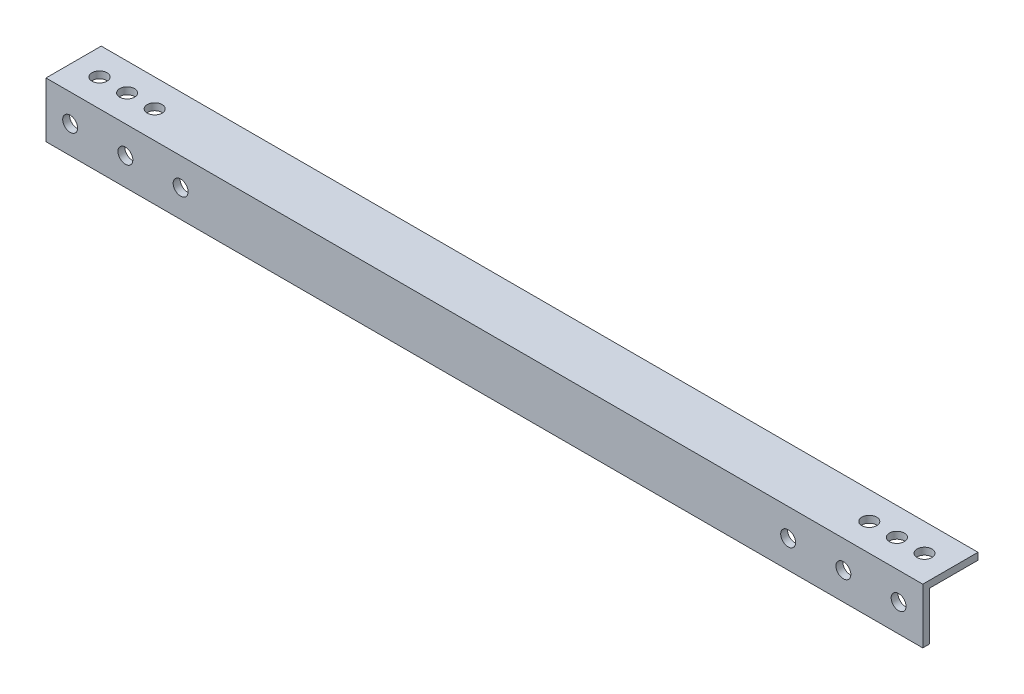
ISO-10303-21;
HEADER;
FILE_DESCRIPTION(('STEP AP214'),'2;1');
FILE_NAME('part.step','',(''),(''),'','','');
FILE_SCHEMA(('AUTOMOTIVE_DESIGN { 1 0 10303 214 1 1 1 1 }'));
ENDSEC;
DATA;
#1=APPLICATION_CONTEXT('core data for automotive mechanical design processes');
#2=APPLICATION_PROTOCOL_DEFINITION('international standard','automotive_design',2000,#1);
#3=PRODUCT_CONTEXT('',#1,'mechanical');
#4=PRODUCT('Part','Part','',(#3));
#5=PRODUCT_RELATED_PRODUCT_CATEGORY('part','',(#4));
#6=PRODUCT_DEFINITION_FORMATION('','',#4);
#7=PRODUCT_DEFINITION_CONTEXT('part definition',#1,'design');
#8=PRODUCT_DEFINITION('design','',#6,#7);
#9=PRODUCT_DEFINITION_SHAPE('','',#8);
#10=(LENGTH_UNIT() NAMED_UNIT(*) SI_UNIT(.MILLI.,.METRE.));
#11=(NAMED_UNIT(*) PLANE_ANGLE_UNIT() SI_UNIT($,.RADIAN.));
#12=(NAMED_UNIT(*) SI_UNIT($,.STERADIAN.) SOLID_ANGLE_UNIT());
#13=UNCERTAINTY_MEASURE_WITH_UNIT(LENGTH_MEASURE(1.E-05),#10,'distance_accuracy_value','');
#14=(GEOMETRIC_REPRESENTATION_CONTEXT(3) GLOBAL_UNCERTAINTY_ASSIGNED_CONTEXT((#13)) GLOBAL_UNIT_ASSIGNED_CONTEXT((#10,
#11,#12)) REPRESENTATION_CONTEXT('',''));
#15=CARTESIAN_POINT('',(0.,0.,0.));
#16=DIRECTION('',(0.,0.,1.));
#17=DIRECTION('',(1.,0.,0.));
#18=AXIS2_PLACEMENT_3D('',#15,#16,#17);
#19=CARTESIAN_POINT('',(403.225,0.,0.));
#20=DIRECTION('',(0.,0.,-1.));
#21=DIRECTION('',(0.,1.,0.));
#22=AXIS2_PLACEMENT_3D('',#19,#20,#21);
#23=PLANE('',#22);
#24=CARTESIAN_POINT('',(11.1125,-12.7,0.));
#25=DIRECTION('',(0.,0.,1.));
#26=DIRECTION('',(1.,0.,0.));
#27=AXIS2_PLACEMENT_3D('',#24,#25,#26);
#28=CIRCLE('',#27,3.429);
#29=CARTESIAN_POINT('',(14.5415,-12.7,0.));
#30=VERTEX_POINT('',#29);
#31=EDGE_CURVE('E173',#30,#30,#28,.T.);
#32=ORIENTED_EDGE('',*,*,#31,.F.);
#33=EDGE_LOOP('',(#32));
#34=FACE_BOUND('',#33,.T.);
#35=CARTESIAN_POINT('',(36.5125,-12.7,0.));
#36=DIRECTION('',(0.,0.,1.));
#37=DIRECTION('',(1.,0.,0.));
#38=AXIS2_PLACEMENT_3D('',#35,#36,#37);
#39=CIRCLE('',#38,3.429);
#40=CARTESIAN_POINT('',(39.9415,-12.7,0.));
#41=VERTEX_POINT('',#40);
#42=EDGE_CURVE('E177',#41,#41,#39,.T.);
#43=ORIENTED_EDGE('',*,*,#42,.F.);
#44=EDGE_LOOP('',(#43));
#45=FACE_BOUND('',#44,.T.);
#46=CARTESIAN_POINT('',(61.9125,-12.7,0.));
#47=DIRECTION('',(0.,0.,1.));
#48=DIRECTION('',(1.,0.,0.));
#49=AXIS2_PLACEMENT_3D('',#46,#47,#48);
#50=CIRCLE('',#49,3.429);
#51=CARTESIAN_POINT('',(65.3415,-12.7,0.));
#52=VERTEX_POINT('',#51);
#53=EDGE_CURVE('E181',#52,#52,#50,.T.);
#54=ORIENTED_EDGE('',*,*,#53,.F.);
#55=EDGE_LOOP('',(#54));
#56=FACE_BOUND('',#55,.T.);
#57=CARTESIAN_POINT('',(341.3125,-12.7,0.));
#58=DIRECTION('',(0.,0.,1.));
#59=DIRECTION('',(-1.,0.,0.));
#60=AXIS2_PLACEMENT_3D('',#57,#58,#59);
#61=CIRCLE('',#60,3.429);
#62=CARTESIAN_POINT('',(337.8835,-12.7,0.));
#63=VERTEX_POINT('',#62);
#64=EDGE_CURVE('E185',#63,#63,#61,.T.);
#65=ORIENTED_EDGE('',*,*,#64,.F.);
#66=EDGE_LOOP('',(#65));
#67=FACE_BOUND('',#66,.T.);
#68=CARTESIAN_POINT('',(366.7125,-12.7,0.));
#69=DIRECTION('',(0.,0.,1.));
#70=DIRECTION('',(-1.,0.,0.));
#71=AXIS2_PLACEMENT_3D('',#68,#69,#70);
#72=CIRCLE('',#71,3.429);
#73=CARTESIAN_POINT('',(363.2835,-12.7,0.));
#74=VERTEX_POINT('',#73);
#75=EDGE_CURVE('E189',#74,#74,#72,.T.);
#76=ORIENTED_EDGE('',*,*,#75,.F.);
#77=EDGE_LOOP('',(#76));
#78=FACE_BOUND('',#77,.T.);
#79=CARTESIAN_POINT('',(392.1125,-12.7,0.));
#80=DIRECTION('',(0.,0.,1.));
#81=DIRECTION('',(-1.,0.,0.));
#82=AXIS2_PLACEMENT_3D('',#79,#80,#81);
#83=CIRCLE('',#82,3.429);
#84=CARTESIAN_POINT('',(388.6835,-12.7,0.));
#85=VERTEX_POINT('',#84);
#86=EDGE_CURVE('E192',#85,#85,#83,.T.);
#87=ORIENTED_EDGE('',*,*,#86,.F.);
#88=EDGE_LOOP('',(#87));
#89=FACE_BOUND('',#88,.T.);
#90=DIRECTION('',(0.,-1.,0.));
#91=VECTOR('',#90,1.);
#92=CARTESIAN_POINT('',(0.,0.,0.));
#93=LINE('',#92,#91);
#94=CARTESIAN_POINT('',(0.,0.,0.));
#95=VERTEX_POINT('',#94);
#96=CARTESIAN_POINT('',(0.,-25.4,0.));
#97=VERTEX_POINT('',#96);
#98=EDGE_CURVE('E127',#95,#97,#93,.T.);
#99=ORIENTED_EDGE('',*,*,#98,.T.);
#100=DIRECTION('',(-1.,0.,0.));
#101=VECTOR('',#100,1.);
#102=CARTESIAN_POINT('',(403.225,-25.4,0.));
#103=LINE('',#102,#101);
#104=CARTESIAN_POINT('',(403.225,-25.4,0.));
#105=VERTEX_POINT('',#104);
#106=EDGE_CURVE('E12',#105,#97,#103,.T.);
#107=ORIENTED_EDGE('',*,*,#106,.F.);
#108=DIRECTION('',(0.,-1.,0.));
#109=VECTOR('',#108,1.);
#110=CARTESIAN_POINT('',(403.225,0.,0.));
#111=LINE('',#110,#109);
#112=CARTESIAN_POINT('',(403.225,0.,0.));
#113=VERTEX_POINT('',#112);
#114=EDGE_CURVE('E138',#113,#105,#111,.T.);
#115=ORIENTED_EDGE('',*,*,#114,.F.);
#116=DIRECTION('',(-1.,0.,0.));
#117=VECTOR('',#116,1.);
#118=CARTESIAN_POINT('',(403.225,0.,0.));
#119=LINE('',#118,#117);
#120=EDGE_CURVE('E123',#113,#95,#119,.T.);
#121=ORIENTED_EDGE('',*,*,#120,.T.);
#122=EDGE_LOOP('',(#99,#107,#115,#121));
#123=FACE_BOUND('',#122,.T.);
#124=ADVANCED_FACE('F43',(#34,#45,#56,#67,#78,#89,#123),#23,.F.);
#125=CARTESIAN_POINT('',(403.225,-25.4,-3.17499999999991));
#126=DIRECTION('',(0.,1.,0.));
#127=DIRECTION('',(0.,0.,1.));
#128=AXIS2_PLACEMENT_3D('',#125,#126,#127);
#129=PLANE('',#128);
#130=DIRECTION('',(0.,0.,-1.));
#131=VECTOR('',#130,1.);
#132=CARTESIAN_POINT('',(0.,-25.4,-3.17499999999991));
#133=LINE('',#132,#131);
#134=CARTESIAN_POINT('',(0.,-25.4,-3.17499999999991));
#135=VERTEX_POINT('',#134);
#136=EDGE_CURVE('E130',#97,#135,#133,.T.);
#137=ORIENTED_EDGE('',*,*,#136,.T.);
#138=DIRECTION('',(-1.,0.,0.));
#139=VECTOR('',#138,1.);
#140=CARTESIAN_POINT('',(403.225,-25.4,-3.17499999999991));
#141=LINE('',#140,#139);
#142=CARTESIAN_POINT('',(403.225,-25.4,-3.17499999999991));
#143=VERTEX_POINT('',#142);
#144=EDGE_CURVE('E51',#143,#135,#141,.T.);
#145=ORIENTED_EDGE('',*,*,#144,.F.);
#146=DIRECTION('',(0.,0.,-1.));
#147=VECTOR('',#146,1.);
#148=CARTESIAN_POINT('',(403.225,-25.4,-3.17499999999991));
#149=LINE('',#148,#147);
#150=EDGE_CURVE('E96',#105,#143,#149,.T.);
#151=ORIENTED_EDGE('',*,*,#150,.F.);
#152=ORIENTED_EDGE('',*,*,#106,.T.);
#153=EDGE_LOOP('',(#137,#145,#151,#152));
#154=FACE_BOUND('',#153,.T.);
#155=ADVANCED_FACE('F165',(#154),#129,.F.);
#156=CARTESIAN_POINT('',(403.225,-3.17500000000001,-3.17499999999999));
#157=DIRECTION('',(0.,0.,1.));
#158=DIRECTION('',(0.,-1.,0.));
#159=AXIS2_PLACEMENT_3D('',#156,#157,#158);
#160=PLANE('',#159);
#161=CARTESIAN_POINT('',(11.1125,-12.7,-3.17499999999996));
#162=DIRECTION('',(0.,0.,1.));
#163=DIRECTION('',(0.,-1.,0.));
#164=AXIS2_PLACEMENT_3D('',#161,#162,#163);
#165=CIRCLE('',#164,3.429);
#166=CARTESIAN_POINT('',(11.1125,-16.129,-3.17499999999994));
#167=VERTEX_POINT('',#166);
#168=EDGE_CURVE('E131',#167,#167,#165,.F.);
#169=ORIENTED_EDGE('',*,*,#168,.F.);
#170=EDGE_LOOP('',(#169));
#171=FACE_BOUND('',#170,.T.);
#172=CARTESIAN_POINT('',(36.5125,-12.7,-3.17499999999996));
#173=DIRECTION('',(0.,0.,1.));
#174=DIRECTION('',(0.,-1.,0.));
#175=AXIS2_PLACEMENT_3D('',#172,#173,#174);
#176=CIRCLE('',#175,3.429);
#177=CARTESIAN_POINT('',(36.5125,-16.129,-3.17499999999994));
#178=VERTEX_POINT('',#177);
#179=EDGE_CURVE('E212',#178,#178,#176,.F.);
#180=ORIENTED_EDGE('',*,*,#179,.F.);
#181=EDGE_LOOP('',(#180));
#182=FACE_BOUND('',#181,.T.);
#183=CARTESIAN_POINT('',(61.9125,-12.7,-3.17499999999996));
#184=DIRECTION('',(0.,0.,1.));
#185=DIRECTION('',(0.,-1.,0.));
#186=AXIS2_PLACEMENT_3D('',#183,#184,#185);
#187=CIRCLE('',#186,3.429);
#188=CARTESIAN_POINT('',(61.9125,-16.129,-3.17499999999994));
#189=VERTEX_POINT('',#188);
#190=EDGE_CURVE('E208',#189,#189,#187,.F.);
#191=ORIENTED_EDGE('',*,*,#190,.F.);
#192=EDGE_LOOP('',(#191));
#193=FACE_BOUND('',#192,.T.);
#194=CARTESIAN_POINT('',(341.3125,-12.7,-3.17499999999996));
#195=DIRECTION('',(0.,0.,1.));
#196=DIRECTION('',(0.,-1.,0.));
#197=AXIS2_PLACEMENT_3D('',#194,#195,#196);
#198=CIRCLE('',#197,3.429);
#199=CARTESIAN_POINT('',(341.3125,-16.1290000000001,-3.17499999999994));
#200=VERTEX_POINT('',#199);
#201=EDGE_CURVE('E205',#200,#200,#198,.F.);
#202=ORIENTED_EDGE('',*,*,#201,.F.);
#203=EDGE_LOOP('',(#202));
#204=FACE_BOUND('',#203,.T.);
#205=CARTESIAN_POINT('',(366.7125,-12.7,-3.17499999999996));
#206=DIRECTION('',(0.,0.,1.));
#207=DIRECTION('',(0.,-1.,0.));
#208=AXIS2_PLACEMENT_3D('',#205,#206,#207);
#209=CIRCLE('',#208,3.429);
#210=CARTESIAN_POINT('',(366.7125,-16.1290000000001,-3.17499999999994));
#211=VERTEX_POINT('',#210);
#212=EDGE_CURVE('E194',#211,#211,#209,.F.);
#213=ORIENTED_EDGE('',*,*,#212,.F.);
#214=EDGE_LOOP('',(#213));
#215=FACE_BOUND('',#214,.T.);
#216=CARTESIAN_POINT('',(392.1125,-12.7,-3.17499999999996));
#217=DIRECTION('',(0.,0.,1.));
#218=DIRECTION('',(0.,-1.,0.));
#219=AXIS2_PLACEMENT_3D('',#216,#217,#218);
#220=CIRCLE('',#219,3.429);
#221=CARTESIAN_POINT('',(392.1125,-16.1290000000001,-3.17499999999994));
#222=VERTEX_POINT('',#221);
#223=EDGE_CURVE('E195',#222,#222,#220,.F.);
#224=ORIENTED_EDGE('',*,*,#223,.F.);
#225=EDGE_LOOP('',(#224));
#226=FACE_BOUND('',#225,.T.);
#227=DIRECTION('',(0.,1.,0.));
#228=VECTOR('',#227,1.);
#229=CARTESIAN_POINT('',(0.,-3.17500000000001,-3.17499999999999));
#230=LINE('',#229,#228);
#231=CARTESIAN_POINT('',(0.,-3.17500000000001,-3.17499999999999));
#232=VERTEX_POINT('',#231);
#233=EDGE_CURVE('E133',#135,#232,#230,.T.);
#234=ORIENTED_EDGE('',*,*,#233,.T.);
#235=DIRECTION('',(-1.,0.,0.));
#236=VECTOR('',#235,1.);
#237=CARTESIAN_POINT('',(403.225,-3.17500000000001,-3.17499999999999));
#238=LINE('',#237,#236);
#239=CARTESIAN_POINT('',(403.225,-3.17500000000001,-3.17499999999999));
#240=VERTEX_POINT('',#239);
#241=EDGE_CURVE('E118',#240,#232,#238,.T.);
#242=ORIENTED_EDGE('',*,*,#241,.F.);
#243=DIRECTION('',(0.,1.,0.));
#244=VECTOR('',#243,1.);
#245=CARTESIAN_POINT('',(403.225,-3.17500000000001,-3.17499999999999));
#246=LINE('',#245,#244);
#247=EDGE_CURVE('E109',#143,#240,#246,.T.);
#248=ORIENTED_EDGE('',*,*,#247,.F.);
#249=ORIENTED_EDGE('',*,*,#144,.T.);
#250=EDGE_LOOP('',(#234,#242,#248,#249));
#251=FACE_BOUND('',#250,.T.);
#252=ADVANCED_FACE('F144',(#171,#182,#193,#204,#215,#226,#251),#160,.F.);
#253=CARTESIAN_POINT('',(403.225,-3.17500000000001,-3.17499999999999));
#254=DIRECTION('',(0.,1.,0.));
#255=DIRECTION('',(0.,0.,1.));
#256=AXIS2_PLACEMENT_3D('',#253,#254,#255);
#257=PLANE('',#256);
#258=CARTESIAN_POINT('',(378.6251,-3.17500000000004,-12.7));
#259=DIRECTION('',(0.,1.,0.));
#260=DIRECTION('',(0.,0.,1.));
#261=AXIS2_PLACEMENT_3D('',#258,#259,#260);
#262=CIRCLE('',#261,3.42900000000006);
#263=CARTESIAN_POINT('',(378.6251,-3.17500000000003,-9.2709999999999));
#264=VERTEX_POINT('',#263);
#265=EDGE_CURVE('E244',#264,#264,#262,.F.);
#266=ORIENTED_EDGE('',*,*,#265,.F.);
#267=EDGE_LOOP('',(#266));
#268=FACE_BOUND('',#267,.T.);
#269=CARTESIAN_POINT('',(391.3251,-3.17500000000004,-12.7));
#270=DIRECTION('',(0.,1.,0.));
#271=DIRECTION('',(0.,0.,1.));
#272=AXIS2_PLACEMENT_3D('',#269,#270,#271);
#273=CIRCLE('',#272,3.429);
#274=CARTESIAN_POINT('',(391.3251,-3.17500000000003,-9.27099999999997));
#275=VERTEX_POINT('',#274);
#276=EDGE_CURVE('E238',#275,#275,#273,.F.);
#277=ORIENTED_EDGE('',*,*,#276,.F.);
#278=EDGE_LOOP('',(#277));
#279=FACE_BOUND('',#278,.T.);
#280=CARTESIAN_POINT('',(11.8999,-3.17500000000004,-12.6999999999999));
#281=DIRECTION('',(0.,1.,0.));
#282=DIRECTION('',(0.,0.,1.));
#283=AXIS2_PLACEMENT_3D('',#280,#281,#282);
#284=CIRCLE('',#283,3.42900000000001);
#285=CARTESIAN_POINT('',(11.8999,-3.17500000000003,-9.27099999999992));
#286=VERTEX_POINT('',#285);
#287=EDGE_CURVE('E230',#286,#286,#284,.F.);
#288=ORIENTED_EDGE('',*,*,#287,.F.);
#289=EDGE_LOOP('',(#288));
#290=FACE_BOUND('',#289,.T.);
#291=CARTESIAN_POINT('',(24.5999,-3.17500000000004,-12.6999999999999));
#292=DIRECTION('',(0.,1.,0.));
#293=DIRECTION('',(0.,0.,1.));
#294=AXIS2_PLACEMENT_3D('',#291,#292,#293);
#295=CIRCLE('',#294,3.42900000000001);
#296=CARTESIAN_POINT('',(24.5999,-3.17500000000003,-9.27099999999992));
#297=VERTEX_POINT('',#296);
#298=EDGE_CURVE('E231',#297,#297,#295,.F.);
#299=ORIENTED_EDGE('',*,*,#298,.F.);
#300=EDGE_LOOP('',(#299));
#301=FACE_BOUND('',#300,.T.);
#302=CARTESIAN_POINT('',(37.2999,-3.17500000000004,-12.6999999999999));
#303=DIRECTION('',(0.,1.,0.));
#304=DIRECTION('',(0.,0.,1.));
#305=AXIS2_PLACEMENT_3D('',#302,#303,#304);
#306=CIRCLE('',#305,3.429);
#307=CARTESIAN_POINT('',(37.2999,-3.17500000000003,-9.27099999999992));
#308=VERTEX_POINT('',#307);
#309=EDGE_CURVE('E253',#308,#308,#306,.F.);
#310=ORIENTED_EDGE('',*,*,#309,.F.);
#311=EDGE_LOOP('',(#310));
#312=FACE_BOUND('',#311,.T.);
#313=CARTESIAN_POINT('',(365.9251,-3.17500000000004,-12.7));
#314=DIRECTION('',(0.,1.,0.));
#315=DIRECTION('',(0.,0.,1.));
#316=AXIS2_PLACEMENT_3D('',#313,#314,#315);
#317=CIRCLE('',#316,3.429);
#318=CARTESIAN_POINT('',(365.9251,-3.17500000000003,-9.27099999999996));
#319=VERTEX_POINT('',#318);
#320=EDGE_CURVE('E200',#319,#319,#317,.F.);
#321=ORIENTED_EDGE('',*,*,#320,.F.);
#322=EDGE_LOOP('',(#321));
#323=FACE_BOUND('',#322,.T.);
#324=DIRECTION('',(0.,0.,-1.));
#325=VECTOR('',#324,1.);
#326=CARTESIAN_POINT('',(0.,-3.17500000000001,-3.17499999999999));
#327=LINE('',#326,#325);
#328=CARTESIAN_POINT('',(0.,-3.17500000000009,-25.4));
#329=VERTEX_POINT('',#328);
#330=EDGE_CURVE('E117',#232,#329,#327,.T.);
#331=ORIENTED_EDGE('',*,*,#330,.T.);
#332=DIRECTION('',(-1.,0.,0.));
#333=VECTOR('',#332,1.);
#334=CARTESIAN_POINT('',(403.225,-3.17500000000009,-25.4));
#335=LINE('',#334,#333);
#336=CARTESIAN_POINT('',(403.225,-3.17500000000009,-25.4));
#337=VERTEX_POINT('',#336);
#338=EDGE_CURVE('E114',#337,#329,#335,.T.);
#339=ORIENTED_EDGE('',*,*,#338,.F.);
#340=DIRECTION('',(0.,0.,-1.));
#341=VECTOR('',#340,1.);
#342=CARTESIAN_POINT('',(403.225,-3.17500000000001,-3.17499999999999));
#343=LINE('',#342,#341);
#344=EDGE_CURVE('E103',#240,#337,#343,.T.);
#345=ORIENTED_EDGE('',*,*,#344,.F.);
#346=ORIENTED_EDGE('',*,*,#241,.T.);
#347=EDGE_LOOP('',(#331,#339,#345,#346));
#348=FACE_BOUND('',#347,.T.);
#349=ADVANCED_FACE('F115',(#268,#279,#290,#301,#312,#323,#348),#257,.F.);
#350=CARTESIAN_POINT('',(403.225,-3.17500000000009,-25.4));
#351=DIRECTION('',(0.,0.,1.));
#352=DIRECTION('',(0.,-1.,0.));
#353=AXIS2_PLACEMENT_3D('',#350,#351,#352);
#354=PLANE('',#353);
#355=DIRECTION('',(0.,1.,0.));
#356=VECTOR('',#355,1.);
#357=CARTESIAN_POINT('',(0.,-3.17500000000009,-25.4));
#358=LINE('',#357,#356);
#359=CARTESIAN_POINT('',(0.,0.,-25.4));
#360=VERTEX_POINT('',#359);
#361=EDGE_CURVE('E82',#329,#360,#358,.T.);
#362=ORIENTED_EDGE('',*,*,#361,.T.);
#363=DIRECTION('',(-1.,0.,0.));
#364=VECTOR('',#363,1.);
#365=CARTESIAN_POINT('',(403.225,0.,-25.4));
#366=LINE('',#365,#364);
#367=CARTESIAN_POINT('',(403.225,0.,-25.4));
#368=VERTEX_POINT('',#367);
#369=EDGE_CURVE('E119',#368,#360,#366,.T.);
#370=ORIENTED_EDGE('',*,*,#369,.F.);
#371=DIRECTION('',(0.,1.,0.));
#372=VECTOR('',#371,1.);
#373=CARTESIAN_POINT('',(403.225,-3.17500000000009,-25.4));
#374=LINE('',#373,#372);
#375=EDGE_CURVE('E107',#337,#368,#374,.T.);
#376=ORIENTED_EDGE('',*,*,#375,.F.);
#377=ORIENTED_EDGE('',*,*,#338,.T.);
#378=EDGE_LOOP('',(#362,#370,#376,#377));
#379=FACE_BOUND('',#378,.T.);
#380=ADVANCED_FACE('F121',(#379),#354,.F.);
#381=CARTESIAN_POINT('',(403.225,0.,0.));
#382=DIRECTION('',(0.,-1.,0.));
#383=DIRECTION('',(0.,0.,-1.));
#384=AXIS2_PLACEMENT_3D('',#381,#382,#383);
#385=PLANE('',#384);
#386=CARTESIAN_POINT('',(378.6251,0.,-12.7));
#387=DIRECTION('',(0.,1.,0.));
#388=DIRECTION('',(0.,0.,-1.));
#389=AXIS2_PLACEMENT_3D('',#386,#387,#388);
#390=CIRCLE('',#389,3.42900000000006);
#391=CARTESIAN_POINT('',(378.6251,0.,-16.129));
#392=VERTEX_POINT('',#391);
#393=EDGE_CURVE('E226',#392,#392,#390,.T.);
#394=ORIENTED_EDGE('',*,*,#393,.F.);
#395=EDGE_LOOP('',(#394));
#396=FACE_BOUND('',#395,.T.);
#397=CARTESIAN_POINT('',(391.3251,0.,-12.7));
#398=DIRECTION('',(0.,1.,0.));
#399=DIRECTION('',(0.,0.,-1.));
#400=AXIS2_PLACEMENT_3D('',#397,#398,#399);
#401=CIRCLE('',#400,3.429);
#402=CARTESIAN_POINT('',(391.3251,0.,-16.129));
#403=VERTEX_POINT('',#402);
#404=EDGE_CURVE('E241',#403,#403,#401,.T.);
#405=ORIENTED_EDGE('',*,*,#404,.F.);
#406=EDGE_LOOP('',(#405));
#407=FACE_BOUND('',#406,.T.);
#408=CARTESIAN_POINT('',(11.8999,0.,-12.6999999999999));
#409=DIRECTION('',(0.,1.,0.));
#410=DIRECTION('',(0.,0.,1.));
#411=AXIS2_PLACEMENT_3D('',#408,#409,#410);
#412=CIRCLE('',#411,3.42900000000001);
#413=CARTESIAN_POINT('',(11.8999,0.,-9.27099999999992));
#414=VERTEX_POINT('',#413);
#415=EDGE_CURVE('E235',#414,#414,#412,.T.);
#416=ORIENTED_EDGE('',*,*,#415,.F.);
#417=EDGE_LOOP('',(#416));
#418=FACE_BOUND('',#417,.T.);
#419=CARTESIAN_POINT('',(24.5999,0.,-12.6999999999999));
#420=DIRECTION('',(0.,1.,0.));
#421=DIRECTION('',(0.,0.,1.));
#422=AXIS2_PLACEMENT_3D('',#419,#420,#421);
#423=CIRCLE('',#422,3.42900000000001);
#424=CARTESIAN_POINT('',(24.5999,0.,-9.27099999999992));
#425=VERTEX_POINT('',#424);
#426=EDGE_CURVE('E227',#425,#425,#423,.T.);
#427=ORIENTED_EDGE('',*,*,#426,.F.);
#428=EDGE_LOOP('',(#427));
#429=FACE_BOUND('',#428,.T.);
#430=CARTESIAN_POINT('',(37.2999,0.,-12.6999999999999));
#431=DIRECTION('',(0.,1.,0.));
#432=DIRECTION('',(0.,0.,1.));
#433=AXIS2_PLACEMENT_3D('',#430,#431,#432);
#434=CIRCLE('',#433,3.429);
#435=CARTESIAN_POINT('',(37.2999,0.,-9.27099999999993));
#436=VERTEX_POINT('',#435);
#437=EDGE_CURVE('E234',#436,#436,#434,.T.);
#438=ORIENTED_EDGE('',*,*,#437,.F.);
#439=EDGE_LOOP('',(#438));
#440=FACE_BOUND('',#439,.T.);
#441=CARTESIAN_POINT('',(365.9251,0.,-12.7));
#442=DIRECTION('',(0.,1.,0.));
#443=DIRECTION('',(0.,0.,-1.));
#444=AXIS2_PLACEMENT_3D('',#441,#442,#443);
#445=CIRCLE('',#444,3.429);
#446=CARTESIAN_POINT('',(365.9251,0.,-16.129));
#447=VERTEX_POINT('',#446);
#448=EDGE_CURVE('E223',#447,#447,#445,.T.);
#449=ORIENTED_EDGE('',*,*,#448,.F.);
#450=EDGE_LOOP('',(#449));
#451=FACE_BOUND('',#450,.T.);
#452=DIRECTION('',(0.,0.,1.));
#453=VECTOR('',#452,1.);
#454=CARTESIAN_POINT('',(0.,0.,0.));
#455=LINE('',#454,#453);
#456=EDGE_CURVE('E88',#360,#95,#455,.T.);
#457=ORIENTED_EDGE('',*,*,#456,.T.);
#458=ORIENTED_EDGE('',*,*,#120,.F.);
#459=DIRECTION('',(0.,0.,1.));
#460=VECTOR('',#459,1.);
#461=CARTESIAN_POINT('',(403.225,0.,0.));
#462=LINE('',#461,#460);
#463=EDGE_CURVE('E59',#368,#113,#462,.T.);
#464=ORIENTED_EDGE('',*,*,#463,.F.);
#465=ORIENTED_EDGE('',*,*,#369,.T.);
#466=EDGE_LOOP('',(#457,#458,#464,#465));
#467=FACE_BOUND('',#466,.T.);
#468=ADVANCED_FACE('F151',(#396,#407,#418,#429,#440,#451,#467),#385,.F.);
#469=CARTESIAN_POINT('',(403.225,0.,0.));
#470=DIRECTION('',(-1.,0.,0.));
#471=DIRECTION('',(0.,0.,1.));
#472=AXIS2_PLACEMENT_3D('',#469,#470,#471);
#473=PLANE('',#472);
#474=ORIENTED_EDGE('',*,*,#114,.T.);
#475=ORIENTED_EDGE('',*,*,#150,.T.);
#476=ORIENTED_EDGE('',*,*,#247,.T.);
#477=ORIENTED_EDGE('',*,*,#344,.T.);
#478=ORIENTED_EDGE('',*,*,#375,.T.);
#479=ORIENTED_EDGE('',*,*,#463,.T.);
#480=EDGE_LOOP('',(#474,#475,#476,#477,#478,#479));
#481=FACE_BOUND('',#480,.T.);
#482=ADVANCED_FACE('F105',(#481),#473,.F.);
#483=CARTESIAN_POINT('',(0.,0.,0.));
#484=DIRECTION('',(-1.,0.,0.));
#485=DIRECTION('',(0.,0.,1.));
#486=AXIS2_PLACEMENT_3D('',#483,#484,#485);
#487=PLANE('',#486);
#488=ORIENTED_EDGE('',*,*,#98,.F.);
#489=ORIENTED_EDGE('',*,*,#456,.F.);
#490=ORIENTED_EDGE('',*,*,#361,.F.);
#491=ORIENTED_EDGE('',*,*,#330,.F.);
#492=ORIENTED_EDGE('',*,*,#233,.F.);
#493=ORIENTED_EDGE('',*,*,#136,.F.);
#494=EDGE_LOOP('',(#488,#489,#490,#491,#492,#493));
#495=FACE_BOUND('',#494,.T.);
#496=ADVANCED_FACE('F147',(#495),#487,.T.);
#497=CARTESIAN_POINT('',(392.1125,-12.7,-12.8736766107547));
#498=DIRECTION('',(0.,0.,1.));
#499=DIRECTION('',(1.,0.,0.));
#500=AXIS2_PLACEMENT_3D('',#497,#498,#499);
#501=CYLINDRICAL_SURFACE('',#500,3.429);
#502=ORIENTED_EDGE('',*,*,#223,.T.);
#503=EDGE_LOOP('',(#502));
#504=FACE_BOUND('',#503,.T.);
#505=ORIENTED_EDGE('',*,*,#86,.T.);
#506=EDGE_LOOP('',(#505));
#507=FACE_BOUND('',#506,.T.);
#508=ADVANCED_FACE('F299',(#504,#507),#501,.F.);
#509=CARTESIAN_POINT('',(366.7125,-12.7,-12.8736766107547));
#510=DIRECTION('',(0.,0.,1.));
#511=DIRECTION('',(1.,0.,0.));
#512=AXIS2_PLACEMENT_3D('',#509,#510,#511);
#513=CYLINDRICAL_SURFACE('',#512,3.429);
#514=ORIENTED_EDGE('',*,*,#212,.T.);
#515=EDGE_LOOP('',(#514));
#516=FACE_BOUND('',#515,.T.);
#517=ORIENTED_EDGE('',*,*,#75,.T.);
#518=EDGE_LOOP('',(#517));
#519=FACE_BOUND('',#518,.T.);
#520=ADVANCED_FACE('F295',(#516,#519),#513,.F.);
#521=CARTESIAN_POINT('',(341.3125,-12.7,-12.8736766107547));
#522=DIRECTION('',(0.,0.,1.));
#523=DIRECTION('',(1.,0.,0.));
#524=AXIS2_PLACEMENT_3D('',#521,#522,#523);
#525=CYLINDRICAL_SURFACE('',#524,3.429);
#526=ORIENTED_EDGE('',*,*,#201,.T.);
#527=EDGE_LOOP('',(#526));
#528=FACE_BOUND('',#527,.T.);
#529=ORIENTED_EDGE('',*,*,#64,.T.);
#530=EDGE_LOOP('',(#529));
#531=FACE_BOUND('',#530,.T.);
#532=ADVANCED_FACE('F291',(#528,#531),#525,.F.);
#533=CARTESIAN_POINT('',(61.9125,-12.7,-12.8736766107547));
#534=DIRECTION('',(0.,0.,1.));
#535=DIRECTION('',(1.,0.,0.));
#536=AXIS2_PLACEMENT_3D('',#533,#534,#535);
#537=CYLINDRICAL_SURFACE('',#536,3.429);
#538=ORIENTED_EDGE('',*,*,#190,.T.);
#539=EDGE_LOOP('',(#538));
#540=FACE_BOUND('',#539,.T.);
#541=ORIENTED_EDGE('',*,*,#53,.T.);
#542=EDGE_LOOP('',(#541));
#543=FACE_BOUND('',#542,.T.);
#544=ADVANCED_FACE('F287',(#540,#543),#537,.F.);
#545=CARTESIAN_POINT('',(36.5125,-12.7,-12.8736766107547));
#546=DIRECTION('',(0.,0.,1.));
#547=DIRECTION('',(1.,0.,0.));
#548=AXIS2_PLACEMENT_3D('',#545,#546,#547);
#549=CYLINDRICAL_SURFACE('',#548,3.429);
#550=ORIENTED_EDGE('',*,*,#179,.T.);
#551=EDGE_LOOP('',(#550));
#552=FACE_BOUND('',#551,.T.);
#553=ORIENTED_EDGE('',*,*,#42,.T.);
#554=EDGE_LOOP('',(#553));
#555=FACE_BOUND('',#554,.T.);
#556=ADVANCED_FACE('F279',(#552,#555),#549,.F.);
#557=CARTESIAN_POINT('',(11.1125,-12.7,-12.8736766107547));
#558=DIRECTION('',(0.,0.,1.));
#559=DIRECTION('',(1.,0.,0.));
#560=AXIS2_PLACEMENT_3D('',#557,#558,#559);
#561=CYLINDRICAL_SURFACE('',#560,3.429);
#562=ORIENTED_EDGE('',*,*,#168,.T.);
#563=EDGE_LOOP('',(#562));
#564=FACE_BOUND('',#563,.T.);
#565=ORIENTED_EDGE('',*,*,#31,.T.);
#566=EDGE_LOOP('',(#565));
#567=FACE_BOUND('',#566,.T.);
#568=ADVANCED_FACE('F269',(#564,#567),#561,.F.);
#569=CARTESIAN_POINT('',(365.9251,-12.8736766107549,-12.6999999999999));
#570=DIRECTION('',(0.,1.,0.));
#571=DIRECTION('',(0.,0.,1.));
#572=AXIS2_PLACEMENT_3D('',#569,#570,#571);
#573=CYLINDRICAL_SURFACE('',#572,3.429);
#574=ORIENTED_EDGE('',*,*,#320,.T.);
#575=EDGE_LOOP('',(#574));
#576=FACE_BOUND('',#575,.T.);
#577=ORIENTED_EDGE('',*,*,#448,.T.);
#578=EDGE_LOOP('',(#577));
#579=FACE_BOUND('',#578,.T.);
#580=ADVANCED_FACE('F266',(#576,#579),#573,.F.);
#581=CARTESIAN_POINT('',(37.2999,-12.8736766107549,-12.6999999999999));
#582=DIRECTION('',(0.,1.,0.));
#583=DIRECTION('',(0.,0.,1.));
#584=AXIS2_PLACEMENT_3D('',#581,#582,#583);
#585=CYLINDRICAL_SURFACE('',#584,3.429);
#586=ORIENTED_EDGE('',*,*,#309,.T.);
#587=EDGE_LOOP('',(#586));
#588=FACE_BOUND('',#587,.T.);
#589=ORIENTED_EDGE('',*,*,#437,.T.);
#590=EDGE_LOOP('',(#589));
#591=FACE_BOUND('',#590,.T.);
#592=ADVANCED_FACE('F257',(#588,#591),#585,.F.);
#593=CARTESIAN_POINT('',(24.5999,-12.8736766107549,-12.6999999999999));
#594=DIRECTION('',(0.,1.,0.));
#595=DIRECTION('',(0.,0.,1.));
#596=AXIS2_PLACEMENT_3D('',#593,#594,#595);
#597=CYLINDRICAL_SURFACE('',#596,3.42900000000001);
#598=ORIENTED_EDGE('',*,*,#298,.T.);
#599=EDGE_LOOP('',(#598));
#600=FACE_BOUND('',#599,.T.);
#601=ORIENTED_EDGE('',*,*,#426,.T.);
#602=EDGE_LOOP('',(#601));
#603=FACE_BOUND('',#602,.T.);
#604=ADVANCED_FACE('F277',(#600,#603),#597,.F.);
#605=CARTESIAN_POINT('',(11.8999,-12.8736766107549,-12.6999999999999));
#606=DIRECTION('',(0.,1.,0.));
#607=DIRECTION('',(0.,0.,1.));
#608=AXIS2_PLACEMENT_3D('',#605,#606,#607);
#609=CYLINDRICAL_SURFACE('',#608,3.42900000000001);
#610=ORIENTED_EDGE('',*,*,#287,.T.);
#611=EDGE_LOOP('',(#610));
#612=FACE_BOUND('',#611,.T.);
#613=ORIENTED_EDGE('',*,*,#415,.T.);
#614=EDGE_LOOP('',(#613));
#615=FACE_BOUND('',#614,.T.);
#616=ADVANCED_FACE('F371',(#612,#615),#609,.F.);
#617=CARTESIAN_POINT('',(391.3251,-12.8736766107549,-12.6999999999999));
#618=DIRECTION('',(0.,1.,0.));
#619=DIRECTION('',(0.,0.,1.));
#620=AXIS2_PLACEMENT_3D('',#617,#618,#619);
#621=CYLINDRICAL_SURFACE('',#620,3.429);
#622=ORIENTED_EDGE('',*,*,#276,.T.);
#623=EDGE_LOOP('',(#622));
#624=FACE_BOUND('',#623,.T.);
#625=ORIENTED_EDGE('',*,*,#404,.T.);
#626=EDGE_LOOP('',(#625));
#627=FACE_BOUND('',#626,.T.);
#628=ADVANCED_FACE('F381',(#624,#627),#621,.F.);
#629=CARTESIAN_POINT('',(378.6251,-12.8736766107549,-12.6999999999999));
#630=DIRECTION('',(0.,1.,0.));
#631=DIRECTION('',(0.,0.,1.));
#632=AXIS2_PLACEMENT_3D('',#629,#630,#631);
#633=CYLINDRICAL_SURFACE('',#632,3.42900000000006);
#634=ORIENTED_EDGE('',*,*,#265,.T.);
#635=EDGE_LOOP('',(#634));
#636=FACE_BOUND('',#635,.T.);
#637=ORIENTED_EDGE('',*,*,#393,.T.);
#638=EDGE_LOOP('',(#637));
#639=FACE_BOUND('',#638,.T.);
#640=ADVANCED_FACE('F391',(#636,#639),#633,.F.);
#641=CLOSED_SHELL('',(#124,#155,#252,#349,#380,#468,#482,#496,#508,#520,#532,#544,#556,#568,
#580,#592,#604,#616,#628,#640));
#642=MANIFOLD_SOLID_BREP('B2',#641);
#643=ADVANCED_BREP_SHAPE_REPRESENTATION('',(#18,#642),#14);
#644=SHAPE_DEFINITION_REPRESENTATION(#9,#643);
ENDSEC;
END-ISO-10303-21;
